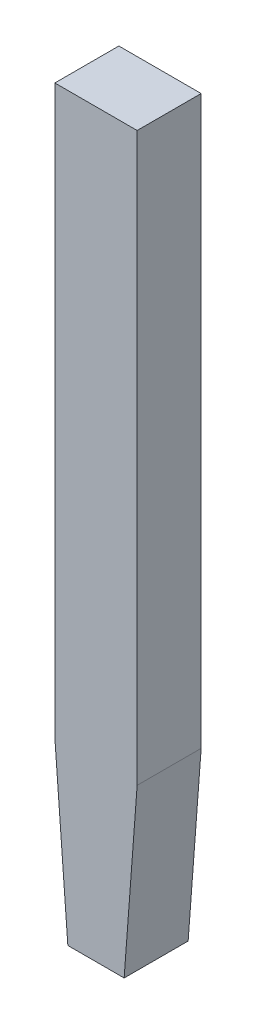
ISO-10303-21;
HEADER;
FILE_DESCRIPTION(('STEP AP214'),'2;1');
FILE_NAME('part.step','',(''),(''),'','','');
FILE_SCHEMA(('AUTOMOTIVE_DESIGN { 1 0 10303 214 1 1 1 1 }'));
ENDSEC;
DATA;
#1=APPLICATION_CONTEXT('core data for automotive mechanical design processes');
#2=APPLICATION_PROTOCOL_DEFINITION('international standard','automotive_design',2000,#1);
#3=PRODUCT_CONTEXT('',#1,'mechanical');
#4=PRODUCT('Part','Part','',(#3));
#5=PRODUCT_RELATED_PRODUCT_CATEGORY('part','',(#4));
#6=PRODUCT_DEFINITION_FORMATION('','',#4);
#7=PRODUCT_DEFINITION_CONTEXT('part definition',#1,'design');
#8=PRODUCT_DEFINITION('design','',#6,#7);
#9=PRODUCT_DEFINITION_SHAPE('','',#8);
#10=(LENGTH_UNIT() NAMED_UNIT(*) SI_UNIT(.MILLI.,.METRE.));
#11=(NAMED_UNIT(*) PLANE_ANGLE_UNIT() SI_UNIT($,.RADIAN.));
#12=(NAMED_UNIT(*) SI_UNIT($,.STERADIAN.) SOLID_ANGLE_UNIT());
#13=UNCERTAINTY_MEASURE_WITH_UNIT(LENGTH_MEASURE(1.E-05),#10,'distance_accuracy_value','');
#14=(GEOMETRIC_REPRESENTATION_CONTEXT(3) GLOBAL_UNCERTAINTY_ASSIGNED_CONTEXT((#13)) GLOBAL_UNIT_ASSIGNED_CONTEXT((#10,
#11,#12)) REPRESENTATION_CONTEXT('',''));
#15=CARTESIAN_POINT('',(0.,0.,0.));
#16=DIRECTION('',(0.,0.,1.));
#17=DIRECTION('',(1.,0.,0.));
#18=AXIS2_PLACEMENT_3D('',#15,#16,#17);
#19=CARTESIAN_POINT('',(45.33457889831,1.696835055312,3.355000000046));
#20=DIRECTION('',(0.,0.,1.));
#21=DIRECTION('',(1.,0.,0.));
#22=AXIS2_PLACEMENT_3D('',#19,#20,#21);
#23=PLANE('',#22);
#24=DIRECTION('',(0.0747899482398054,0.997199309888594,0.));
#25=VECTOR('',#24,1.);
#26=CARTESIAN_POINT('',(47.20847160493,-15.17126218978,3.355000000046));
#27=LINE('',#26,#25);
#28=CARTESIAN_POINT('',(47.2084716049296,-15.17126218978,3.355000000046));
#29=VERTEX_POINT('',#28);
#30=CARTESIAN_POINT('',(47.27957889831,-14.22316494469,3.355000000046));
#31=VERTEX_POINT('',#30);
#32=EDGE_CURVE('E83',#29,#31,#27,.T.);
#33=ORIENTED_EDGE('',*,*,#32,.F.);
#34=DIRECTION('',(1.,0.,0.));
#35=VECTOR('',#34,1.);
#36=CARTESIAN_POINT('',(45.33457889831,-15.17126218978,3.355000000046));
#37=LINE('',#36,#35);
#38=CARTESIAN_POINT('',(46.9006861916904,-15.17126218978,3.355000000046));
#39=VERTEX_POINT('',#38);
#40=EDGE_CURVE('E66',#39,#29,#37,.T.);
#41=ORIENTED_EDGE('',*,*,#40,.F.);
#42=DIRECTION('',(0.0747899482398054,-0.997199309888594,0.));
#43=VECTOR('',#42,1.);
#44=CARTESIAN_POINT('',(46.82957889831,-14.22316494469,3.355000000046));
#45=LINE('',#44,#43);
#46=CARTESIAN_POINT('',(46.82957889831,-14.2231649446899,3.355000000046));
#47=VERTEX_POINT('',#46);
#48=EDGE_CURVE('E20',#47,#39,#45,.T.);
#49=ORIENTED_EDGE('',*,*,#48,.F.);
#50=DIRECTION('',(0.,1.,0.));
#51=VECTOR('',#50,1.);
#52=CARTESIAN_POINT('',(46.82957889831,-10.46816494469,3.355000000046));
#53=LINE('',#52,#51);
#54=CARTESIAN_POINT('',(46.82957889831,-11.12202888849,3.355000000046));
#55=VERTEX_POINT('',#54);
#56=EDGE_CURVE('E96',#55,#47,#53,.F.);
#57=ORIENTED_EDGE('',*,*,#56,.F.);
#58=DIRECTION('',(1.,0.,0.));
#59=VECTOR('',#58,1.);
#60=CARTESIAN_POINT('',(44.47457889831,-11.12202888849,3.355000000046));
#61=LINE('',#60,#59);
#62=CARTESIAN_POINT('',(47.27957889831,-11.12202888849,3.355000000046));
#63=VERTEX_POINT('',#62);
#64=EDGE_CURVE('E89',#55,#63,#61,.T.);
#65=ORIENTED_EDGE('',*,*,#64,.T.);
#66=DIRECTION('',(0.,1.,0.));
#67=VECTOR('',#66,1.);
#68=CARTESIAN_POINT('',(47.27957889831,-10.46816494469,3.355000000046));
#69=LINE('',#68,#67);
#70=EDGE_CURVE('E84',#31,#63,#69,.T.);
#71=ORIENTED_EDGE('',*,*,#70,.F.);
#72=EDGE_LOOP('',(#33,#41,#49,#57,#65,#71));
#73=FACE_BOUND('',#72,.T.);
#74=ADVANCED_FACE('F17',(#73),#23,.F.);
#75=CARTESIAN_POINT('',(47.27957889831,-10.46816494469,3.355000000046));
#76=DIRECTION('',(1.,0.,0.));
#77=DIRECTION('',(0.,0.,-1.));
#78=AXIS2_PLACEMENT_3D('',#75,#76,#77);
#79=PLANE('',#78);
#80=DIRECTION('',(0.,1.,0.));
#81=VECTOR('',#80,1.);
#82=CARTESIAN_POINT('',(47.27957889831,1.696835055312,3.705000000046));
#83=LINE('',#82,#81);
#84=CARTESIAN_POINT('',(47.27957889831,-14.2231649446898,3.705000000046));
#85=VERTEX_POINT('',#84);
#86=CARTESIAN_POINT('',(47.27957889831,-11.12202888849,3.705000000046));
#87=VERTEX_POINT('',#86);
#88=EDGE_CURVE('E103',#85,#87,#83,.T.);
#89=ORIENTED_EDGE('',*,*,#88,.F.);
#90=DIRECTION('',(0.,0.,1.));
#91=VECTOR('',#90,1.);
#92=CARTESIAN_POINT('',(47.27957889831,-14.22316494469,3.355000000046));
#93=LINE('',#92,#91);
#94=EDGE_CURVE('E100',#31,#85,#93,.T.);
#95=ORIENTED_EDGE('',*,*,#94,.F.);
#96=ORIENTED_EDGE('',*,*,#70,.T.);
#97=DIRECTION('',(0.,0.,-1.));
#98=VECTOR('',#97,1.);
#99=CARTESIAN_POINT('',(47.27957889831,-11.12202888849,-0.158278306686));
#100=LINE('',#99,#98);
#101=EDGE_CURVE('E91',#63,#87,#100,.F.);
#102=ORIENTED_EDGE('',*,*,#101,.T.);
#103=EDGE_LOOP('',(#89,#95,#96,#102));
#104=FACE_BOUND('',#103,.T.);
#105=ADVANCED_FACE('F124',(#104),#79,.T.);
#106=CARTESIAN_POINT('',(44.47457889831,-11.12202888849,-0.158278306686));
#107=DIRECTION('',(0.,-1.,0.));
#108=DIRECTION('',(0.,0.,-1.));
#109=AXIS2_PLACEMENT_3D('',#106,#107,#108);
#110=PLANE('',#109);
#111=ORIENTED_EDGE('',*,*,#64,.F.);
#112=DIRECTION('',(0.,0.,1.));
#113=VECTOR('',#112,1.);
#114=CARTESIAN_POINT('',(46.82957889831,-11.12202888849,3.355000000046));
#115=LINE('',#114,#113);
#116=CARTESIAN_POINT('',(46.82957889831,-11.12202888849,3.705000000046));
#117=VERTEX_POINT('',#116);
#118=EDGE_CURVE('E93',#117,#55,#115,.F.);
#119=ORIENTED_EDGE('',*,*,#118,.F.);
#120=DIRECTION('',(1.,0.,0.));
#121=VECTOR('',#120,1.);
#122=CARTESIAN_POINT('',(45.33457889831,-11.12202888849,3.705000000046));
#123=LINE('',#122,#121);
#124=EDGE_CURVE('E106',#87,#117,#123,.F.);
#125=ORIENTED_EDGE('',*,*,#124,.F.);
#126=ORIENTED_EDGE('',*,*,#101,.F.);
#127=EDGE_LOOP('',(#111,#119,#125,#126));
#128=FACE_BOUND('',#127,.T.);
#129=ADVANCED_FACE('F125',(#128),#110,.F.);
#130=CARTESIAN_POINT('',(46.82957889831,-10.46816494469,3.355000000046));
#131=DIRECTION('',(-1.,0.,0.));
#132=DIRECTION('',(0.,0.,1.));
#133=AXIS2_PLACEMENT_3D('',#130,#131,#132);
#134=PLANE('',#133);
#135=ORIENTED_EDGE('',*,*,#56,.T.);
#136=DIRECTION('',(0.,0.,1.));
#137=VECTOR('',#136,1.);
#138=CARTESIAN_POINT('',(46.82957889831,-14.22316494469,3.355000000046));
#139=LINE('',#138,#137);
#140=CARTESIAN_POINT('',(46.82957889831,-14.2231649446899,3.705000000046));
#141=VERTEX_POINT('',#140);
#142=EDGE_CURVE('E73',#141,#47,#139,.F.);
#143=ORIENTED_EDGE('',*,*,#142,.F.);
#144=DIRECTION('',(0.,1.,0.));
#145=VECTOR('',#144,1.);
#146=CARTESIAN_POINT('',(46.82957889831,1.696835055312,3.705000000046));
#147=LINE('',#146,#145);
#148=EDGE_CURVE('E109',#117,#141,#147,.F.);
#149=ORIENTED_EDGE('',*,*,#148,.F.);
#150=ORIENTED_EDGE('',*,*,#118,.T.);
#151=EDGE_LOOP('',(#135,#143,#149,#150));
#152=FACE_BOUND('',#151,.T.);
#153=ADVANCED_FACE('F119',(#152),#134,.T.);
#154=CARTESIAN_POINT('',(46.82957889831,-14.22316494469,3.355000000046));
#155=DIRECTION('',(-0.997199309888458,-0.0747899482416168,0.));
#156=DIRECTION('',(0.0747899482416168,-0.997199309888458,0.));
#157=AXIS2_PLACEMENT_3D('',#154,#155,#156);
#158=PLANE('',#157);
#159=DIRECTION('',(0.0747899482398054,-0.997199309888594,0.));
#160=VECTOR('',#159,1.);
#161=CARTESIAN_POINT('',(46.82957889831,-14.22316494469,3.705000000046));
#162=LINE('',#161,#160);
#163=CARTESIAN_POINT('',(46.9006861916909,-15.1712621897799,3.705000000046));
#164=VERTEX_POINT('',#163);
#165=EDGE_CURVE('E112',#141,#164,#162,.T.);
#166=ORIENTED_EDGE('',*,*,#165,.F.);
#167=ORIENTED_EDGE('',*,*,#142,.T.);
#168=ORIENTED_EDGE('',*,*,#48,.T.);
#169=DIRECTION('',(0.,0.,1.));
#170=VECTOR('',#169,1.);
#171=CARTESIAN_POINT('',(46.90068619169,-15.17126218978,-0.8137967800219));
#172=LINE('',#171,#170);
#173=EDGE_CURVE('E72',#39,#164,#172,.T.);
#174=ORIENTED_EDGE('',*,*,#173,.T.);
#175=EDGE_LOOP('',(#166,#167,#168,#174));
#176=FACE_BOUND('',#175,.T.);
#177=ADVANCED_FACE('F71',(#176),#158,.T.);
#178=CARTESIAN_POINT('',(38.93957889831,-15.17126218978,-0.8137967800219));
#179=DIRECTION('',(0.,1.,0.));
#180=DIRECTION('',(0.,0.,1.));
#181=AXIS2_PLACEMENT_3D('',#178,#179,#180);
#182=PLANE('',#181);
#183=ORIENTED_EDGE('',*,*,#40,.T.);
#184=DIRECTION('',(0.,0.,1.));
#185=VECTOR('',#184,1.);
#186=CARTESIAN_POINT('',(47.2084716049283,-15.1712621897799,3.355000000046));
#187=LINE('',#186,#185);
#188=CARTESIAN_POINT('',(47.2084716049296,-15.17126218978,3.705000000046));
#189=VERTEX_POINT('',#188);
#190=EDGE_CURVE('E35',#189,#29,#187,.F.);
#191=ORIENTED_EDGE('',*,*,#190,.F.);
#192=DIRECTION('',(1.,0.,0.));
#193=VECTOR('',#192,1.);
#194=CARTESIAN_POINT('',(45.33457889831,-15.17126218978,3.705000000046));
#195=LINE('',#194,#193);
#196=EDGE_CURVE('E26',#164,#189,#195,.T.);
#197=ORIENTED_EDGE('',*,*,#196,.F.);
#198=ORIENTED_EDGE('',*,*,#173,.F.);
#199=EDGE_LOOP('',(#183,#191,#197,#198));
#200=FACE_BOUND('',#199,.T.);
#201=ADVANCED_FACE('F77',(#200),#182,.F.);
#202=CARTESIAN_POINT('',(47.27957889831,-14.22316494469,3.355000000046));
#203=DIRECTION('',(0.997199309888458,-0.0747899482416168,0.));
#204=DIRECTION('',(0.0747899482416168,0.997199309888458,0.));
#205=AXIS2_PLACEMENT_3D('',#202,#203,#204);
#206=PLANE('',#205);
#207=ORIENTED_EDGE('',*,*,#32,.T.);
#208=ORIENTED_EDGE('',*,*,#94,.T.);
#209=DIRECTION('',(0.0747899482398054,0.997199309888594,0.));
#210=VECTOR('',#209,1.);
#211=CARTESIAN_POINT('',(47.20847160493,-15.17126218978,3.705000000046));
#212=LINE('',#211,#210);
#213=EDGE_CURVE('E11',#189,#85,#212,.T.);
#214=ORIENTED_EDGE('',*,*,#213,.F.);
#215=ORIENTED_EDGE('',*,*,#190,.T.);
#216=EDGE_LOOP('',(#207,#208,#214,#215));
#217=FACE_BOUND('',#216,.T.);
#218=ADVANCED_FACE('F127',(#217),#206,.T.);
#219=CARTESIAN_POINT('',(45.33457889831,1.696835055312,3.705000000046));
#220=DIRECTION('',(0.,0.,1.));
#221=DIRECTION('',(1.,0.,0.));
#222=AXIS2_PLACEMENT_3D('',#219,#220,#221);
#223=PLANE('',#222);
#224=ORIENTED_EDGE('',*,*,#196,.T.);
#225=ORIENTED_EDGE('',*,*,#213,.T.);
#226=ORIENTED_EDGE('',*,*,#88,.T.);
#227=ORIENTED_EDGE('',*,*,#124,.T.);
#228=ORIENTED_EDGE('',*,*,#148,.T.);
#229=ORIENTED_EDGE('',*,*,#165,.T.);
#230=EDGE_LOOP('',(#224,#225,#226,#227,#228,#229));
#231=FACE_BOUND('',#230,.T.);
#232=ADVANCED_FACE('F115',(#231),#223,.T.);
#233=CLOSED_SHELL('',(#74,#105,#129,#153,#177,#201,#218,#232));
#234=MANIFOLD_SOLID_BREP('B1',#233);
#235=ADVANCED_BREP_SHAPE_REPRESENTATION('',(#18,#234),#14);
#236=SHAPE_DEFINITION_REPRESENTATION(#9,#235);
ENDSEC;
END-ISO-10303-21;
